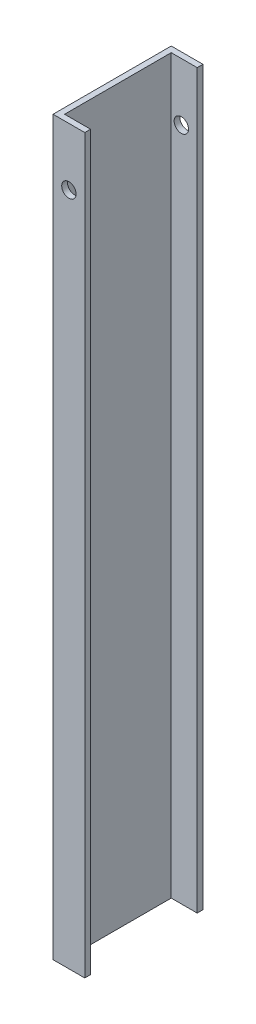
ISO-10303-21;
HEADER;
FILE_DESCRIPTION(('STEP AP214'),'2;1');
FILE_NAME('part.step','',(''),(''),'','','');
FILE_SCHEMA(('AUTOMOTIVE_DESIGN { 1 0 10303 214 1 1 1 1 }'));
ENDSEC;
DATA;
#1=APPLICATION_CONTEXT('core data for automotive mechanical design processes');
#2=APPLICATION_PROTOCOL_DEFINITION('international standard','automotive_design',2000,#1);
#3=PRODUCT_CONTEXT('',#1,'mechanical');
#4=PRODUCT('Part','Part','',(#3));
#5=PRODUCT_RELATED_PRODUCT_CATEGORY('part','',(#4));
#6=PRODUCT_DEFINITION_FORMATION('','',#4);
#7=PRODUCT_DEFINITION_CONTEXT('part definition',#1,'design');
#8=PRODUCT_DEFINITION('design','',#6,#7);
#9=PRODUCT_DEFINITION_SHAPE('','',#8);
#10=(LENGTH_UNIT() NAMED_UNIT(*) SI_UNIT(.MILLI.,.METRE.));
#11=(NAMED_UNIT(*) PLANE_ANGLE_UNIT() SI_UNIT($,.RADIAN.));
#12=(NAMED_UNIT(*) SI_UNIT($,.STERADIAN.) SOLID_ANGLE_UNIT());
#13=UNCERTAINTY_MEASURE_WITH_UNIT(LENGTH_MEASURE(1.E-05),#10,'distance_accuracy_value','');
#14=(GEOMETRIC_REPRESENTATION_CONTEXT(3) GLOBAL_UNCERTAINTY_ASSIGNED_CONTEXT((#13)) GLOBAL_UNIT_ASSIGNED_CONTEXT((#10,
#11,#12)) REPRESENTATION_CONTEXT('',''));
#15=CARTESIAN_POINT('',(0.,0.,0.));
#16=DIRECTION('',(0.,0.,1.));
#17=DIRECTION('',(1.,0.,0.));
#18=AXIS2_PLACEMENT_3D('',#15,#16,#17);
#19=CARTESIAN_POINT('',(11.,254.,0.));
#20=DIRECTION('',(0.,0.,-1.));
#21=DIRECTION('',(-1.,0.,0.));
#22=AXIS2_PLACEMENT_3D('',#19,#20,#21);
#23=PLANE('',#22);
#24=CARTESIAN_POINT('',(5.5,234.,0.));
#25=DIRECTION('',(0.,0.,1.));
#26=DIRECTION('',(1.,0.,0.));
#27=AXIS2_PLACEMENT_3D('',#24,#25,#26);
#28=CIRCLE('',#27,2.5);
#29=CARTESIAN_POINT('',(8.,234.,0.));
#30=VERTEX_POINT('',#29);
#31=EDGE_CURVE('E182',#30,#30,#28,.T.);
#32=ORIENTED_EDGE('',*,*,#31,.F.);
#33=EDGE_LOOP('',(#32));
#34=FACE_BOUND('',#33,.T.);
#35=DIRECTION('',(1.,0.,0.));
#36=VECTOR('',#35,1.);
#37=CARTESIAN_POINT('',(11.,0.,0.));
#38=LINE('',#37,#36);
#39=CARTESIAN_POINT('',(0.,0.,0.));
#40=VERTEX_POINT('',#39);
#41=CARTESIAN_POINT('',(11.,0.,0.));
#42=VERTEX_POINT('',#41);
#43=EDGE_CURVE('E128',#40,#42,#38,.T.);
#44=ORIENTED_EDGE('',*,*,#43,.T.);
#45=DIRECTION('',(0.,-1.,0.));
#46=VECTOR('',#45,1.);
#47=CARTESIAN_POINT('',(11.,254.,0.));
#48=LINE('',#47,#46);
#49=CARTESIAN_POINT('',(11.,254.,0.));
#50=VERTEX_POINT('',#49);
#51=EDGE_CURVE('E11',#50,#42,#48,.T.);
#52=ORIENTED_EDGE('',*,*,#51,.F.);
#53=DIRECTION('',(1.,0.,0.));
#54=VECTOR('',#53,1.);
#55=CARTESIAN_POINT('',(11.,254.,0.));
#56=LINE('',#55,#54);
#57=CARTESIAN_POINT('',(0.,254.,0.));
#58=VERTEX_POINT('',#57);
#59=EDGE_CURVE('E143',#58,#50,#56,.T.);
#60=ORIENTED_EDGE('',*,*,#59,.F.);
#61=DIRECTION('',(0.,-1.,0.));
#62=VECTOR('',#61,1.);
#63=CARTESIAN_POINT('',(0.,254.,0.));
#64=LINE('',#63,#62);
#65=EDGE_CURVE('E124',#58,#40,#64,.T.);
#66=ORIENTED_EDGE('',*,*,#65,.T.);
#67=EDGE_LOOP('',(#44,#52,#60,#66));
#68=FACE_BOUND('',#67,.T.);
#69=ADVANCED_FACE('F32',(#34,#68),#23,.F.);
#70=CARTESIAN_POINT('',(11.,254.,-2.));
#71=DIRECTION('',(-1.,0.,0.));
#72=DIRECTION('',(0.,0.,1.));
#73=AXIS2_PLACEMENT_3D('',#70,#71,#72);
#74=PLANE('',#73);
#75=DIRECTION('',(0.,0.,-1.));
#76=VECTOR('',#75,1.);
#77=CARTESIAN_POINT('',(11.,0.,-2.));
#78=LINE('',#77,#76);
#79=CARTESIAN_POINT('',(11.,0.,-2.));
#80=VERTEX_POINT('',#79);
#81=EDGE_CURVE('E131',#42,#80,#78,.T.);
#82=ORIENTED_EDGE('',*,*,#81,.T.);
#83=DIRECTION('',(0.,-1.,0.));
#84=VECTOR('',#83,1.);
#85=CARTESIAN_POINT('',(11.,254.,-2.));
#86=LINE('',#85,#84);
#87=CARTESIAN_POINT('',(11.,254.,-2.));
#88=VERTEX_POINT('',#87);
#89=EDGE_CURVE('E40',#88,#80,#86,.T.);
#90=ORIENTED_EDGE('',*,*,#89,.F.);
#91=DIRECTION('',(0.,0.,-1.));
#92=VECTOR('',#91,1.);
#93=CARTESIAN_POINT('',(11.,254.,-2.));
#94=LINE('',#93,#92);
#95=EDGE_CURVE('E91',#50,#88,#94,.T.);
#96=ORIENTED_EDGE('',*,*,#95,.F.);
#97=ORIENTED_EDGE('',*,*,#51,.T.);
#98=EDGE_LOOP('',(#82,#90,#96,#97));
#99=FACE_BOUND('',#98,.T.);
#100=ADVANCED_FACE('F205',(#99),#74,.F.);
#101=CARTESIAN_POINT('',(2.,254.,-2.));
#102=DIRECTION('',(0.,0.,1.));
#103=DIRECTION('',(1.,0.,0.));
#104=AXIS2_PLACEMENT_3D('',#101,#102,#103);
#105=PLANE('',#104);
#106=CARTESIAN_POINT('',(5.5,234.,-2.));
#107=DIRECTION('',(0.,0.,1.));
#108=DIRECTION('',(1.,0.,0.));
#109=AXIS2_PLACEMENT_3D('',#106,#107,#108);
#110=CIRCLE('',#109,2.5);
#111=CARTESIAN_POINT('',(8.,234.,-2.));
#112=VERTEX_POINT('',#111);
#113=EDGE_CURVE('E132',#112,#112,#110,.T.);
#114=ORIENTED_EDGE('',*,*,#113,.T.);
#115=EDGE_LOOP('',(#114));
#116=FACE_BOUND('',#115,.T.);
#117=DIRECTION('',(-1.,0.,0.));
#118=VECTOR('',#117,1.);
#119=CARTESIAN_POINT('',(2.,0.,-2.));
#120=LINE('',#119,#118);
#121=CARTESIAN_POINT('',(2.,0.,-2.));
#122=VERTEX_POINT('',#121);
#123=EDGE_CURVE('E134',#80,#122,#120,.T.);
#124=ORIENTED_EDGE('',*,*,#123,.T.);
#125=DIRECTION('',(0.,-1.,0.));
#126=VECTOR('',#125,1.);
#127=CARTESIAN_POINT('',(2.,254.,-2.));
#128=LINE('',#127,#126);
#129=CARTESIAN_POINT('',(2.,254.,-2.));
#130=VERTEX_POINT('',#129);
#131=EDGE_CURVE('E150',#130,#122,#128,.T.);
#132=ORIENTED_EDGE('',*,*,#131,.F.);
#133=DIRECTION('',(-1.,0.,0.));
#134=VECTOR('',#133,1.);
#135=CARTESIAN_POINT('',(2.,254.,-2.));
#136=LINE('',#135,#134);
#137=EDGE_CURVE('E158',#88,#130,#136,.T.);
#138=ORIENTED_EDGE('',*,*,#137,.F.);
#139=ORIENTED_EDGE('',*,*,#89,.T.);
#140=EDGE_LOOP('',(#124,#132,#138,#139));
#141=FACE_BOUND('',#140,.T.);
#142=ADVANCED_FACE('F156',(#116,#141),#105,.F.);
#143=CARTESIAN_POINT('',(2.00000000000001,254.,-39.));
#144=DIRECTION('',(-1.,0.,0.));
#145=DIRECTION('',(0.,0.,1.));
#146=AXIS2_PLACEMENT_3D('',#143,#144,#145);
#147=PLANE('',#146);
#148=DIRECTION('',(0.,0.,-1.));
#149=VECTOR('',#148,1.);
#150=CARTESIAN_POINT('',(2.00000000000001,0.,-39.));
#151=LINE('',#150,#149);
#152=CARTESIAN_POINT('',(2.00000000000001,0.,-39.));
#153=VERTEX_POINT('',#152);
#154=EDGE_CURVE('E136',#122,#153,#151,.T.);
#155=ORIENTED_EDGE('',*,*,#154,.T.);
#156=DIRECTION('',(0.,-1.,0.));
#157=VECTOR('',#156,1.);
#158=CARTESIAN_POINT('',(2.00000000000001,254.,-39.));
#159=LINE('',#158,#157);
#160=CARTESIAN_POINT('',(2.00000000000001,254.,-39.));
#161=VERTEX_POINT('',#160);
#162=EDGE_CURVE('E147',#161,#153,#159,.T.);
#163=ORIENTED_EDGE('',*,*,#162,.F.);
#164=DIRECTION('',(0.,0.,-1.));
#165=VECTOR('',#164,1.);
#166=CARTESIAN_POINT('',(2.00000000000001,254.,-39.));
#167=LINE('',#166,#165);
#168=EDGE_CURVE('E170',#130,#161,#167,.T.);
#169=ORIENTED_EDGE('',*,*,#168,.F.);
#170=ORIENTED_EDGE('',*,*,#131,.T.);
#171=EDGE_LOOP('',(#155,#163,#169,#170));
#172=FACE_BOUND('',#171,.T.);
#173=ADVANCED_FACE('F166',(#172),#147,.F.);
#174=CARTESIAN_POINT('',(11.,254.,-39.));
#175=DIRECTION('',(0.,0.,-1.));
#176=DIRECTION('',(-1.,0.,0.));
#177=AXIS2_PLACEMENT_3D('',#174,#175,#176);
#178=PLANE('',#177);
#179=CARTESIAN_POINT('',(5.5,234.,-39.));
#180=DIRECTION('',(0.,0.,-1.));
#181=DIRECTION('',(-1.,0.,0.));
#182=AXIS2_PLACEMENT_3D('',#179,#180,#181);
#183=CIRCLE('',#182,2.5);
#184=CARTESIAN_POINT('',(3.,234.,-39.));
#185=VERTEX_POINT('',#184);
#186=EDGE_CURVE('E178',#185,#185,#183,.T.);
#187=ORIENTED_EDGE('',*,*,#186,.T.);
#188=EDGE_LOOP('',(#187));
#189=FACE_BOUND('',#188,.T.);
#190=DIRECTION('',(1.,0.,0.));
#191=VECTOR('',#190,1.);
#192=CARTESIAN_POINT('',(11.,0.,-39.));
#193=LINE('',#192,#191);
#194=CARTESIAN_POINT('',(11.,0.,-39.));
#195=VERTEX_POINT('',#194);
#196=EDGE_CURVE('E138',#153,#195,#193,.T.);
#197=ORIENTED_EDGE('',*,*,#196,.T.);
#198=DIRECTION('',(0.,-1.,0.));
#199=VECTOR('',#198,1.);
#200=CARTESIAN_POINT('',(11.,254.,-39.));
#201=LINE('',#200,#199);
#202=CARTESIAN_POINT('',(11.,254.,-39.));
#203=VERTEX_POINT('',#202);
#204=EDGE_CURVE('E119',#203,#195,#201,.T.);
#205=ORIENTED_EDGE('',*,*,#204,.F.);
#206=DIRECTION('',(1.,0.,0.));
#207=VECTOR('',#206,1.);
#208=CARTESIAN_POINT('',(11.,254.,-39.));
#209=LINE('',#208,#207);
#210=EDGE_CURVE('E110',#161,#203,#209,.T.);
#211=ORIENTED_EDGE('',*,*,#210,.F.);
#212=ORIENTED_EDGE('',*,*,#162,.T.);
#213=EDGE_LOOP('',(#197,#205,#211,#212));
#214=FACE_BOUND('',#213,.T.);
#215=ADVANCED_FACE('F169',(#189,#214),#178,.F.);
#216=CARTESIAN_POINT('',(11.,254.,-41.));
#217=DIRECTION('',(-1.,0.,0.));
#218=DIRECTION('',(0.,0.,1.));
#219=AXIS2_PLACEMENT_3D('',#216,#217,#218);
#220=PLANE('',#219);
#221=DIRECTION('',(0.,0.,-1.));
#222=VECTOR('',#221,1.);
#223=CARTESIAN_POINT('',(11.,0.,-41.));
#224=LINE('',#223,#222);
#225=CARTESIAN_POINT('',(11.,0.,-41.));
#226=VERTEX_POINT('',#225);
#227=EDGE_CURVE('E118',#195,#226,#224,.T.);
#228=ORIENTED_EDGE('',*,*,#227,.T.);
#229=DIRECTION('',(0.,-1.,0.));
#230=VECTOR('',#229,1.);
#231=CARTESIAN_POINT('',(11.,254.,-41.));
#232=LINE('',#231,#230);
#233=CARTESIAN_POINT('',(11.,254.,-41.));
#234=VERTEX_POINT('',#233);
#235=EDGE_CURVE('E115',#234,#226,#232,.T.);
#236=ORIENTED_EDGE('',*,*,#235,.F.);
#237=DIRECTION('',(0.,0.,-1.));
#238=VECTOR('',#237,1.);
#239=CARTESIAN_POINT('',(11.,254.,-41.));
#240=LINE('',#239,#238);
#241=EDGE_CURVE('E104',#203,#234,#240,.T.);
#242=ORIENTED_EDGE('',*,*,#241,.F.);
#243=ORIENTED_EDGE('',*,*,#204,.T.);
#244=EDGE_LOOP('',(#228,#236,#242,#243));
#245=FACE_BOUND('',#244,.T.);
#246=ADVANCED_FACE('F116',(#245),#220,.F.);
#247=CARTESIAN_POINT('',(0.,254.,-41.));
#248=DIRECTION('',(0.,0.,1.));
#249=DIRECTION('',(1.,0.,0.));
#250=AXIS2_PLACEMENT_3D('',#247,#248,#249);
#251=PLANE('',#250);
#252=CARTESIAN_POINT('',(5.5,234.,-41.));
#253=DIRECTION('',(0.,0.,1.));
#254=DIRECTION('',(1.,0.,0.));
#255=AXIS2_PLACEMENT_3D('',#252,#253,#254);
#256=CIRCLE('',#255,2.5);
#257=CARTESIAN_POINT('',(8.,234.,-41.));
#258=VERTEX_POINT('',#257);
#259=EDGE_CURVE('E181',#258,#258,#256,.T.);
#260=ORIENTED_EDGE('',*,*,#259,.T.);
#261=EDGE_LOOP('',(#260));
#262=FACE_BOUND('',#261,.T.);
#263=DIRECTION('',(-1.,0.,0.));
#264=VECTOR('',#263,1.);
#265=CARTESIAN_POINT('',(0.,0.,-41.));
#266=LINE('',#265,#264);
#267=CARTESIAN_POINT('',(0.,0.,-41.));
#268=VERTEX_POINT('',#267);
#269=EDGE_CURVE('E77',#226,#268,#266,.T.);
#270=ORIENTED_EDGE('',*,*,#269,.T.);
#271=DIRECTION('',(0.,-1.,0.));
#272=VECTOR('',#271,1.);
#273=CARTESIAN_POINT('',(0.,254.,-41.));
#274=LINE('',#273,#272);
#275=CARTESIAN_POINT('',(0.,254.,-41.));
#276=VERTEX_POINT('',#275);
#277=EDGE_CURVE('E120',#276,#268,#274,.T.);
#278=ORIENTED_EDGE('',*,*,#277,.F.);
#279=DIRECTION('',(-1.,0.,0.));
#280=VECTOR('',#279,1.);
#281=CARTESIAN_POINT('',(0.,254.,-41.));
#282=LINE('',#281,#280);
#283=EDGE_CURVE('E108',#234,#276,#282,.T.);
#284=ORIENTED_EDGE('',*,*,#283,.F.);
#285=ORIENTED_EDGE('',*,*,#235,.T.);
#286=EDGE_LOOP('',(#270,#278,#284,#285));
#287=FACE_BOUND('',#286,.T.);
#288=ADVANCED_FACE('F122',(#262,#287),#251,.F.);
#289=CARTESIAN_POINT('',(0.,254.,0.));
#290=DIRECTION('',(1.,0.,0.));
#291=DIRECTION('',(0.,0.,-1.));
#292=AXIS2_PLACEMENT_3D('',#289,#290,#291);
#293=PLANE('',#292);
#294=DIRECTION('',(0.,0.,1.));
#295=VECTOR('',#294,1.);
#296=CARTESIAN_POINT('',(0.,0.,0.));
#297=LINE('',#296,#295);
#298=EDGE_CURVE('E83',#268,#40,#297,.T.);
#299=ORIENTED_EDGE('',*,*,#298,.T.);
#300=ORIENTED_EDGE('',*,*,#65,.F.);
#301=DIRECTION('',(0.,0.,1.));
#302=VECTOR('',#301,1.);
#303=CARTESIAN_POINT('',(0.,254.,0.));
#304=LINE('',#303,#302);
#305=EDGE_CURVE('E48',#276,#58,#304,.T.);
#306=ORIENTED_EDGE('',*,*,#305,.F.);
#307=ORIENTED_EDGE('',*,*,#277,.T.);
#308=EDGE_LOOP('',(#299,#300,#306,#307));
#309=FACE_BOUND('',#308,.T.);
#310=ADVANCED_FACE('F214',(#309),#293,.F.);
#311=CARTESIAN_POINT('',(0.,254.,0.));
#312=DIRECTION('',(0.,-1.,0.));
#313=DIRECTION('',(0.,0.,-1.));
#314=AXIS2_PLACEMENT_3D('',#311,#312,#313);
#315=PLANE('',#314);
#316=ORIENTED_EDGE('',*,*,#59,.T.);
#317=ORIENTED_EDGE('',*,*,#95,.T.);
#318=ORIENTED_EDGE('',*,*,#137,.T.);
#319=ORIENTED_EDGE('',*,*,#168,.T.);
#320=ORIENTED_EDGE('',*,*,#210,.T.);
#321=ORIENTED_EDGE('',*,*,#241,.T.);
#322=ORIENTED_EDGE('',*,*,#283,.T.);
#323=ORIENTED_EDGE('',*,*,#305,.T.);
#324=EDGE_LOOP('',(#316,#317,#318,#319,#320,#321,#322,#323));
#325=FACE_BOUND('',#324,.T.);
#326=ADVANCED_FACE('F106',(#325),#315,.F.);
#327=CARTESIAN_POINT('',(0.,0.,0.));
#328=DIRECTION('',(0.,-1.,0.));
#329=DIRECTION('',(0.,0.,-1.));
#330=AXIS2_PLACEMENT_3D('',#327,#328,#329);
#331=PLANE('',#330);
#332=ORIENTED_EDGE('',*,*,#43,.F.);
#333=ORIENTED_EDGE('',*,*,#298,.F.);
#334=ORIENTED_EDGE('',*,*,#269,.F.);
#335=ORIENTED_EDGE('',*,*,#227,.F.);
#336=ORIENTED_EDGE('',*,*,#196,.F.);
#337=ORIENTED_EDGE('',*,*,#154,.F.);
#338=ORIENTED_EDGE('',*,*,#123,.F.);
#339=ORIENTED_EDGE('',*,*,#81,.F.);
#340=EDGE_LOOP('',(#332,#333,#334,#335,#336,#337,#338,#339));
#341=FACE_BOUND('',#340,.T.);
#342=ADVANCED_FACE('F162',(#341),#331,.T.);
#343=CARTESIAN_POINT('',(5.5,234.,-41.));
#344=DIRECTION('',(0.,0.,1.));
#345=DIRECTION('',(1.,0.,0.));
#346=AXIS2_PLACEMENT_3D('',#343,#344,#345);
#347=CYLINDRICAL_SURFACE('',#346,2.5);
#348=ORIENTED_EDGE('',*,*,#259,.F.);
#349=EDGE_LOOP('',(#348));
#350=FACE_BOUND('',#349,.T.);
#351=ORIENTED_EDGE('',*,*,#186,.F.);
#352=EDGE_LOOP('',(#351));
#353=FACE_BOUND('',#352,.T.);
#354=ADVANCED_FACE('F189',(#350,#353),#347,.F.);
#355=ORIENTED_EDGE('',*,*,#31,.T.);
#356=EDGE_LOOP('',(#355));
#357=FACE_BOUND('',#356,.T.);
#358=ORIENTED_EDGE('',*,*,#113,.F.);
#359=EDGE_LOOP('',(#358));
#360=FACE_BOUND('',#359,.T.);
#361=ADVANCED_FACE('F192',(#357,#360),#347,.F.);
#362=CLOSED_SHELL('',(#69,#100,#142,#173,#215,#246,#288,#310,#326,#342,#354,#361));
#363=MANIFOLD_SOLID_BREP('B2',#362);
#364=ADVANCED_BREP_SHAPE_REPRESENTATION('',(#18,#363),#14);
#365=SHAPE_DEFINITION_REPRESENTATION(#9,#364);
ENDSEC;
END-ISO-10303-21;
